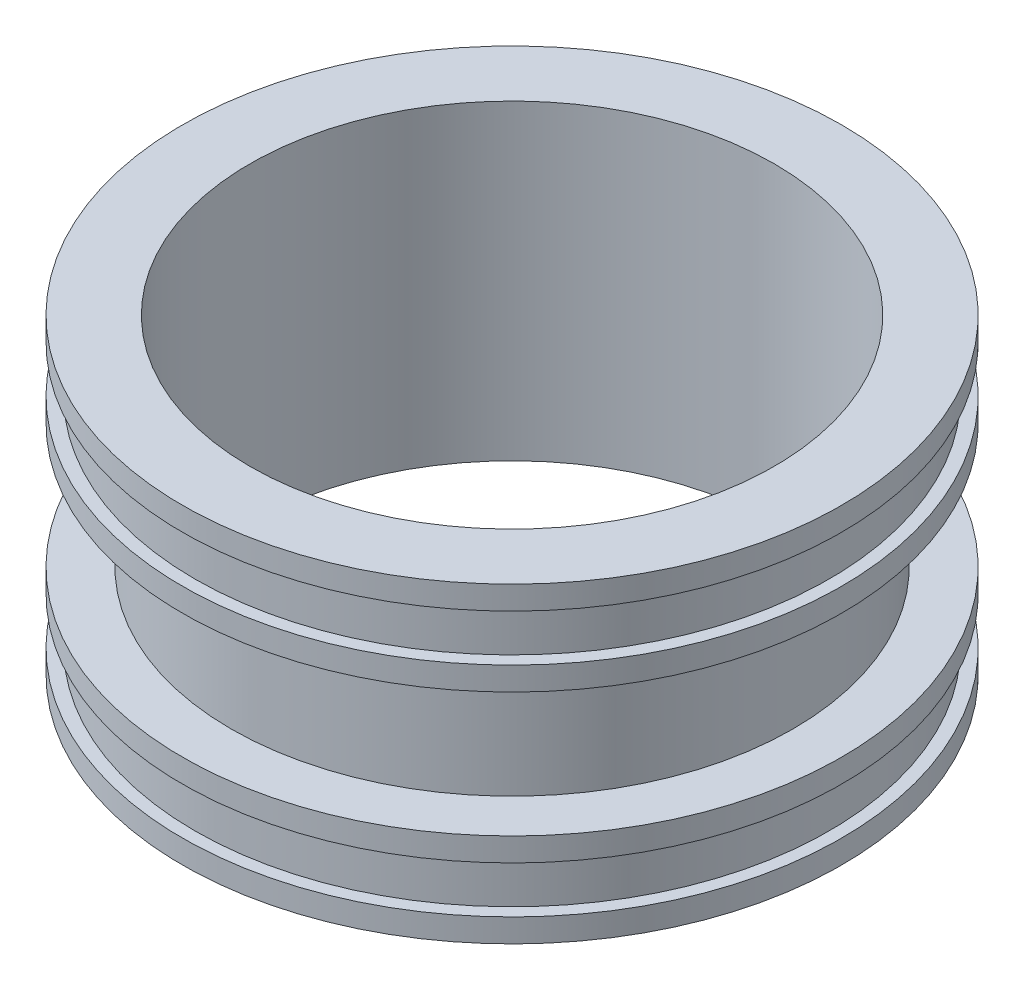
ISO-10303-21;
HEADER;
FILE_DESCRIPTION(('STEP AP214'),'2;1');
FILE_NAME('part.step','',(''),(''),'','','');
FILE_SCHEMA(('AUTOMOTIVE_DESIGN { 1 0 10303 214 1 1 1 1 }'));
ENDSEC;
DATA;
#1=APPLICATION_CONTEXT('core data for automotive mechanical design processes');
#2=APPLICATION_PROTOCOL_DEFINITION('international standard','automotive_design',2000,#1);
#3=PRODUCT_CONTEXT('',#1,'mechanical');
#4=PRODUCT('Part','Part','',(#3));
#5=PRODUCT_RELATED_PRODUCT_CATEGORY('part','',(#4));
#6=PRODUCT_DEFINITION_FORMATION('','',#4);
#7=PRODUCT_DEFINITION_CONTEXT('part definition',#1,'design');
#8=PRODUCT_DEFINITION('design','',#6,#7);
#9=PRODUCT_DEFINITION_SHAPE('','',#8);
#10=(LENGTH_UNIT() NAMED_UNIT(*) SI_UNIT(.MILLI.,.METRE.));
#11=(NAMED_UNIT(*) PLANE_ANGLE_UNIT() SI_UNIT($,.RADIAN.));
#12=(NAMED_UNIT(*) SI_UNIT($,.STERADIAN.) SOLID_ANGLE_UNIT());
#13=UNCERTAINTY_MEASURE_WITH_UNIT(LENGTH_MEASURE(1.E-05),#10,'distance_accuracy_value','');
#14=(GEOMETRIC_REPRESENTATION_CONTEXT(3) GLOBAL_UNCERTAINTY_ASSIGNED_CONTEXT((#13)) GLOBAL_UNIT_ASSIGNED_CONTEXT((#10,
#11,#12)) REPRESENTATION_CONTEXT('',''));
#15=CARTESIAN_POINT('',(0.,0.,0.));
#16=DIRECTION('',(0.,0.,1.));
#17=DIRECTION('',(1.,0.,0.));
#18=AXIS2_PLACEMENT_3D('',#15,#16,#17);
#19=CARTESIAN_POINT('',(0.,0.,0.));
#20=DIRECTION('',(0.,-1.,0.));
#21=DIRECTION('',(0.,0.,-1.));
#22=AXIS2_PLACEMENT_3D('',#19,#20,#21);
#23=CYLINDRICAL_SURFACE('',#22,84.14);
#24=CARTESIAN_POINT('',(0.,0.,0.));
#25=DIRECTION('',(0.,-1.,0.));
#26=DIRECTION('',(0.,0.,-1.));
#27=AXIS2_PLACEMENT_3D('',#24,#25,#26);
#28=CIRCLE('',#27,84.14);
#29=CARTESIAN_POINT('',(0.,0.,-84.14));
#30=VERTEX_POINT('',#29);
#31=EDGE_CURVE('E92',#30,#30,#28,.T.);
#32=ORIENTED_EDGE('',*,*,#31,.T.);
#33=EDGE_LOOP('',(#32));
#34=FACE_BOUND('',#33,.T.);
#35=CARTESIAN_POINT('',(0.,100.,0.));
#36=DIRECTION('',(0.,-1.,0.));
#37=DIRECTION('',(0.,0.,-1.));
#38=AXIS2_PLACEMENT_3D('',#35,#36,#37);
#39=CIRCLE('',#38,84.14);
#40=CARTESIAN_POINT('',(0.,100.,-84.14));
#41=VERTEX_POINT('',#40);
#42=EDGE_CURVE('E12',#41,#41,#39,.T.);
#43=ORIENTED_EDGE('',*,*,#42,.F.);
#44=EDGE_LOOP('',(#43));
#45=FACE_BOUND('',#44,.T.);
#46=ADVANCED_FACE('F40',(#34,#45),#23,.F.);
#47=CARTESIAN_POINT('',(84.1400000000001,100.,0.));
#48=DIRECTION('',(0.,1.,0.));
#49=DIRECTION('',(0.,0.,1.));
#50=AXIS2_PLACEMENT_3D('',#47,#48,#49);
#51=PLANE('',#50);
#52=ORIENTED_EDGE('',*,*,#42,.T.);
#53=EDGE_LOOP('',(#52));
#54=FACE_BOUND('',#53,.T.);
#55=CARTESIAN_POINT('',(0.,100.,0.));
#56=DIRECTION('',(0.,-1.,0.));
#57=DIRECTION('',(0.,0.,-1.));
#58=AXIS2_PLACEMENT_3D('',#55,#56,#57);
#59=CIRCLE('',#58,105.78);
#60=CARTESIAN_POINT('',(0.,100.,-105.78));
#61=VERTEX_POINT('',#60);
#62=EDGE_CURVE('E46',#61,#61,#59,.T.);
#63=ORIENTED_EDGE('',*,*,#62,.F.);
#64=EDGE_LOOP('',(#63));
#65=FACE_BOUND('',#64,.T.);
#66=ADVANCED_FACE('F110',(#54,#65),#51,.T.);
#67=CARTESIAN_POINT('',(0.,0.,0.));
#68=DIRECTION('',(0.,-1.,0.));
#69=DIRECTION('',(0.,0.,-1.));
#70=AXIS2_PLACEMENT_3D('',#67,#68,#69);
#71=CYLINDRICAL_SURFACE('',#70,105.78);
#72=ORIENTED_EDGE('',*,*,#62,.T.);
#73=EDGE_LOOP('',(#72));
#74=FACE_BOUND('',#73,.T.);
#75=CARTESIAN_POINT('',(0.,92.5000000000003,0.));
#76=DIRECTION('',(0.,-1.,0.));
#77=DIRECTION('',(0.,0.,-1.));
#78=AXIS2_PLACEMENT_3D('',#75,#76,#77);
#79=CIRCLE('',#78,105.78);
#80=CARTESIAN_POINT('',(0.,92.5000000000003,-105.78));
#81=VERTEX_POINT('',#80);
#82=EDGE_CURVE('E50',#81,#81,#79,.T.);
#83=ORIENTED_EDGE('',*,*,#82,.F.);
#84=EDGE_LOOP('',(#83));
#85=FACE_BOUND('',#84,.T.);
#86=ADVANCED_FACE('F114',(#74,#85),#71,.T.);
#87=CARTESIAN_POINT('',(105.78,92.5000000000003,0.));
#88=DIRECTION('',(0.,-1.,0.));
#89=DIRECTION('',(0.,0.,-1.));
#90=AXIS2_PLACEMENT_3D('',#87,#88,#89);
#91=PLANE('',#90);
#92=ORIENTED_EDGE('',*,*,#82,.T.);
#93=EDGE_LOOP('',(#92));
#94=FACE_BOUND('',#93,.T.);
#95=CARTESIAN_POINT('',(0.,92.5000000000003,0.));
#96=DIRECTION('',(0.,-1.,0.));
#97=DIRECTION('',(0.,0.,-1.));
#98=AXIS2_PLACEMENT_3D('',#95,#96,#97);
#99=CIRCLE('',#98,101.78);
#100=CARTESIAN_POINT('',(0.,92.5000000000003,-101.78));
#101=VERTEX_POINT('',#100);
#102=EDGE_CURVE('E54',#101,#101,#99,.T.);
#103=ORIENTED_EDGE('',*,*,#102,.F.);
#104=EDGE_LOOP('',(#103));
#105=FACE_BOUND('',#104,.T.);
#106=ADVANCED_FACE('F118',(#94,#105),#91,.T.);
#107=CARTESIAN_POINT('',(0.,0.,0.));
#108=DIRECTION('',(0.,-1.,0.));
#109=DIRECTION('',(0.,0.,-1.));
#110=AXIS2_PLACEMENT_3D('',#107,#108,#109);
#111=CYLINDRICAL_SURFACE('',#110,101.78);
#112=ORIENTED_EDGE('',*,*,#102,.T.);
#113=EDGE_LOOP('',(#112));
#114=FACE_BOUND('',#113,.T.);
#115=CARTESIAN_POINT('',(0.,77.5000000000001,0.));
#116=DIRECTION('',(0.,-1.,0.));
#117=DIRECTION('',(0.,0.,-1.));
#118=AXIS2_PLACEMENT_3D('',#115,#116,#117);
#119=CIRCLE('',#118,101.78);
#120=CARTESIAN_POINT('',(0.,77.5000000000001,-101.78));
#121=VERTEX_POINT('',#120);
#122=EDGE_CURVE('E59',#121,#121,#119,.T.);
#123=ORIENTED_EDGE('',*,*,#122,.F.);
#124=EDGE_LOOP('',(#123));
#125=FACE_BOUND('',#124,.T.);
#126=ADVANCED_FACE('F124',(#114,#125),#111,.T.);
#127=CARTESIAN_POINT('',(101.78,77.5000000000001,0.));
#128=DIRECTION('',(0.,1.,0.));
#129=DIRECTION('',(0.,0.,1.));
#130=AXIS2_PLACEMENT_3D('',#127,#128,#129);
#131=PLANE('',#130);
#132=ORIENTED_EDGE('',*,*,#122,.T.);
#133=EDGE_LOOP('',(#132));
#134=FACE_BOUND('',#133,.T.);
#135=CARTESIAN_POINT('',(0.,77.5000000000001,0.));
#136=DIRECTION('',(0.,-1.,0.));
#137=DIRECTION('',(0.,0.,-1.));
#138=AXIS2_PLACEMENT_3D('',#135,#136,#137);
#139=CIRCLE('',#138,105.78);
#140=CARTESIAN_POINT('',(0.,77.5000000000001,-105.78));
#141=VERTEX_POINT('',#140);
#142=EDGE_CURVE('E62',#141,#141,#139,.T.);
#143=ORIENTED_EDGE('',*,*,#142,.F.);
#144=EDGE_LOOP('',(#143));
#145=FACE_BOUND('',#144,.T.);
#146=ADVANCED_FACE('F128',(#134,#145),#131,.T.);
#147=CARTESIAN_POINT('',(0.,0.,0.));
#148=DIRECTION('',(0.,-1.,0.));
#149=DIRECTION('',(0.,0.,-1.));
#150=AXIS2_PLACEMENT_3D('',#147,#148,#149);
#151=CYLINDRICAL_SURFACE('',#150,105.78);
#152=ORIENTED_EDGE('',*,*,#142,.T.);
#153=EDGE_LOOP('',(#152));
#154=FACE_BOUND('',#153,.T.);
#155=CARTESIAN_POINT('',(0.,70.0000000000001,0.));
#156=DIRECTION('',(0.,-1.,0.));
#157=DIRECTION('',(0.,0.,-1.));
#158=AXIS2_PLACEMENT_3D('',#155,#156,#157);
#159=CIRCLE('',#158,105.78);
#160=CARTESIAN_POINT('',(0.,70.0000000000001,-105.78));
#161=VERTEX_POINT('',#160);
#162=EDGE_CURVE('E65',#161,#161,#159,.T.);
#163=ORIENTED_EDGE('',*,*,#162,.F.);
#164=EDGE_LOOP('',(#163));
#165=FACE_BOUND('',#164,.T.);
#166=ADVANCED_FACE('F132',(#154,#165),#151,.T.);
#167=CARTESIAN_POINT('',(105.78,70.0000000000001,0.));
#168=DIRECTION('',(0.,-1.,0.));
#169=DIRECTION('',(0.,0.,-1.));
#170=AXIS2_PLACEMENT_3D('',#167,#168,#169);
#171=PLANE('',#170);
#172=ORIENTED_EDGE('',*,*,#162,.T.);
#173=EDGE_LOOP('',(#172));
#174=FACE_BOUND('',#173,.T.);
#175=CARTESIAN_POINT('',(0.,70.0000000000001,0.));
#176=DIRECTION('',(0.,-1.,0.));
#177=DIRECTION('',(0.,0.,-1.));
#178=AXIS2_PLACEMENT_3D('',#175,#176,#177);
#179=CIRCLE('',#178,90.14);
#180=CARTESIAN_POINT('',(0.,70.0000000000001,-90.14));
#181=VERTEX_POINT('',#180);
#182=EDGE_CURVE('E68',#181,#181,#179,.T.);
#183=ORIENTED_EDGE('',*,*,#182,.F.);
#184=EDGE_LOOP('',(#183));
#185=FACE_BOUND('',#184,.T.);
#186=ADVANCED_FACE('F136',(#174,#185),#171,.T.);
#187=CARTESIAN_POINT('',(0.,0.,0.));
#188=DIRECTION('',(0.,-1.,0.));
#189=DIRECTION('',(0.,0.,-1.));
#190=AXIS2_PLACEMENT_3D('',#187,#188,#189);
#191=CYLINDRICAL_SURFACE('',#190,90.14);
#192=ORIENTED_EDGE('',*,*,#182,.T.);
#193=EDGE_LOOP('',(#192));
#194=FACE_BOUND('',#193,.T.);
#195=CARTESIAN_POINT('',(0.,30.,0.));
#196=DIRECTION('',(0.,-1.,0.));
#197=DIRECTION('',(0.,0.,-1.));
#198=AXIS2_PLACEMENT_3D('',#195,#196,#197);
#199=CIRCLE('',#198,90.14);
#200=CARTESIAN_POINT('',(0.,30.,-90.14));
#201=VERTEX_POINT('',#200);
#202=EDGE_CURVE('E71',#201,#201,#199,.T.);
#203=ORIENTED_EDGE('',*,*,#202,.F.);
#204=EDGE_LOOP('',(#203));
#205=FACE_BOUND('',#204,.T.);
#206=ADVANCED_FACE('F140',(#194,#205),#191,.T.);
#207=CARTESIAN_POINT('',(90.1400000000001,30.,0.));
#208=DIRECTION('',(0.,1.,0.));
#209=DIRECTION('',(0.,0.,1.));
#210=AXIS2_PLACEMENT_3D('',#207,#208,#209);
#211=PLANE('',#210);
#212=ORIENTED_EDGE('',*,*,#202,.T.);
#213=EDGE_LOOP('',(#212));
#214=FACE_BOUND('',#213,.T.);
#215=CARTESIAN_POINT('',(0.,30.,0.));
#216=DIRECTION('',(0.,-1.,0.));
#217=DIRECTION('',(0.,0.,-1.));
#218=AXIS2_PLACEMENT_3D('',#215,#216,#217);
#219=CIRCLE('',#218,105.78);
#220=CARTESIAN_POINT('',(0.,30.,-105.78));
#221=VERTEX_POINT('',#220);
#222=EDGE_CURVE('E74',#221,#221,#219,.T.);
#223=ORIENTED_EDGE('',*,*,#222,.F.);
#224=EDGE_LOOP('',(#223));
#225=FACE_BOUND('',#224,.T.);
#226=ADVANCED_FACE('F144',(#214,#225),#211,.T.);
#227=CARTESIAN_POINT('',(0.,0.,0.));
#228=DIRECTION('',(0.,-1.,0.));
#229=DIRECTION('',(0.,0.,-1.));
#230=AXIS2_PLACEMENT_3D('',#227,#228,#229);
#231=CYLINDRICAL_SURFACE('',#230,105.78);
#232=ORIENTED_EDGE('',*,*,#222,.T.);
#233=EDGE_LOOP('',(#232));
#234=FACE_BOUND('',#233,.T.);
#235=CARTESIAN_POINT('',(0.,22.5,0.));
#236=DIRECTION('',(0.,-1.,0.));
#237=DIRECTION('',(0.,0.,-1.));
#238=AXIS2_PLACEMENT_3D('',#235,#236,#237);
#239=CIRCLE('',#238,105.78);
#240=CARTESIAN_POINT('',(0.,22.5,-105.78));
#241=VERTEX_POINT('',#240);
#242=EDGE_CURVE('E77',#241,#241,#239,.T.);
#243=ORIENTED_EDGE('',*,*,#242,.F.);
#244=EDGE_LOOP('',(#243));
#245=FACE_BOUND('',#244,.T.);
#246=ADVANCED_FACE('F148',(#234,#245),#231,.T.);
#247=CARTESIAN_POINT('',(101.78,22.5,0.));
#248=DIRECTION('',(0.,-1.,0.));
#249=DIRECTION('',(0.,0.,-1.));
#250=AXIS2_PLACEMENT_3D('',#247,#248,#249);
#251=PLANE('',#250);
#252=ORIENTED_EDGE('',*,*,#242,.T.);
#253=EDGE_LOOP('',(#252));
#254=FACE_BOUND('',#253,.T.);
#255=CARTESIAN_POINT('',(0.,22.5,0.));
#256=DIRECTION('',(0.,-1.,0.));
#257=DIRECTION('',(0.,0.,-1.));
#258=AXIS2_PLACEMENT_3D('',#255,#256,#257);
#259=CIRCLE('',#258,101.78);
#260=CARTESIAN_POINT('',(0.,22.5,-101.78));
#261=VERTEX_POINT('',#260);
#262=EDGE_CURVE('E80',#261,#261,#259,.T.);
#263=ORIENTED_EDGE('',*,*,#262,.F.);
#264=EDGE_LOOP('',(#263));
#265=FACE_BOUND('',#264,.T.);
#266=ADVANCED_FACE('F152',(#254,#265),#251,.T.);
#267=CARTESIAN_POINT('',(0.,0.,0.));
#268=DIRECTION('',(0.,-1.,0.));
#269=DIRECTION('',(0.,0.,-1.));
#270=AXIS2_PLACEMENT_3D('',#267,#268,#269);
#271=CYLINDRICAL_SURFACE('',#270,101.78);
#272=ORIENTED_EDGE('',*,*,#262,.T.);
#273=EDGE_LOOP('',(#272));
#274=FACE_BOUND('',#273,.T.);
#275=CARTESIAN_POINT('',(0.,7.50000000000006,0.));
#276=DIRECTION('',(0.,-1.,0.));
#277=DIRECTION('',(0.,0.,-1.));
#278=AXIS2_PLACEMENT_3D('',#275,#276,#277);
#279=CIRCLE('',#278,101.78);
#280=CARTESIAN_POINT('',(0.,7.50000000000006,-101.78));
#281=VERTEX_POINT('',#280);
#282=EDGE_CURVE('E83',#281,#281,#279,.T.);
#283=ORIENTED_EDGE('',*,*,#282,.F.);
#284=EDGE_LOOP('',(#283));
#285=FACE_BOUND('',#284,.T.);
#286=ADVANCED_FACE('F156',(#274,#285),#271,.T.);
#287=CARTESIAN_POINT('',(105.78,7.50000000000006,0.));
#288=DIRECTION('',(0.,1.,0.));
#289=DIRECTION('',(0.,0.,1.));
#290=AXIS2_PLACEMENT_3D('',#287,#288,#289);
#291=PLANE('',#290);
#292=ORIENTED_EDGE('',*,*,#282,.T.);
#293=EDGE_LOOP('',(#292));
#294=FACE_BOUND('',#293,.T.);
#295=CARTESIAN_POINT('',(0.,7.50000000000006,0.));
#296=DIRECTION('',(0.,-1.,0.));
#297=DIRECTION('',(0.,0.,-1.));
#298=AXIS2_PLACEMENT_3D('',#295,#296,#297);
#299=CIRCLE('',#298,105.78);
#300=CARTESIAN_POINT('',(0.,7.50000000000006,-105.78));
#301=VERTEX_POINT('',#300);
#302=EDGE_CURVE('E86',#301,#301,#299,.T.);
#303=ORIENTED_EDGE('',*,*,#302,.F.);
#304=EDGE_LOOP('',(#303));
#305=FACE_BOUND('',#304,.T.);
#306=ADVANCED_FACE('F106',(#294,#305),#291,.T.);
#307=CARTESIAN_POINT('',(0.,0.,0.));
#308=DIRECTION('',(0.,-1.,0.));
#309=DIRECTION('',(0.,0.,-1.));
#310=AXIS2_PLACEMENT_3D('',#307,#308,#309);
#311=CYLINDRICAL_SURFACE('',#310,105.78);
#312=ORIENTED_EDGE('',*,*,#302,.T.);
#313=EDGE_LOOP('',(#312));
#314=FACE_BOUND('',#313,.T.);
#315=CARTESIAN_POINT('',(0.,0.,0.));
#316=DIRECTION('',(0.,-1.,0.));
#317=DIRECTION('',(0.,0.,-1.));
#318=AXIS2_PLACEMENT_3D('',#315,#316,#317);
#319=CIRCLE('',#318,105.78);
#320=CARTESIAN_POINT('',(0.,0.,-105.78));
#321=VERTEX_POINT('',#320);
#322=EDGE_CURVE('E89',#321,#321,#319,.T.);
#323=ORIENTED_EDGE('',*,*,#322,.F.);
#324=EDGE_LOOP('',(#323));
#325=FACE_BOUND('',#324,.T.);
#326=ADVANCED_FACE('F100',(#314,#325),#311,.T.);
#327=CARTESIAN_POINT('',(105.78,0.,0.));
#328=DIRECTION('',(0.,-1.,0.));
#329=DIRECTION('',(0.,0.,-1.));
#330=AXIS2_PLACEMENT_3D('',#327,#328,#329);
#331=PLANE('',#330);
#332=ORIENTED_EDGE('',*,*,#322,.T.);
#333=EDGE_LOOP('',(#332));
#334=FACE_BOUND('',#333,.T.);
#335=ORIENTED_EDGE('',*,*,#31,.F.);
#336=EDGE_LOOP('',(#335));
#337=FACE_BOUND('',#336,.T.);
#338=ADVANCED_FACE('F98',(#334,#337),#331,.T.);
#339=CLOSED_SHELL('',(#46,#66,#86,#106,#126,#146,#166,#186,#206,#226,#246,#266,#286,#306,#326,#338));
#340=MANIFOLD_SOLID_BREP('B2',#339);
#341=ADVANCED_BREP_SHAPE_REPRESENTATION('',(#18,#340),#14);
#342=SHAPE_DEFINITION_REPRESENTATION(#9,#341);
ENDSEC;
END-ISO-10303-21;
